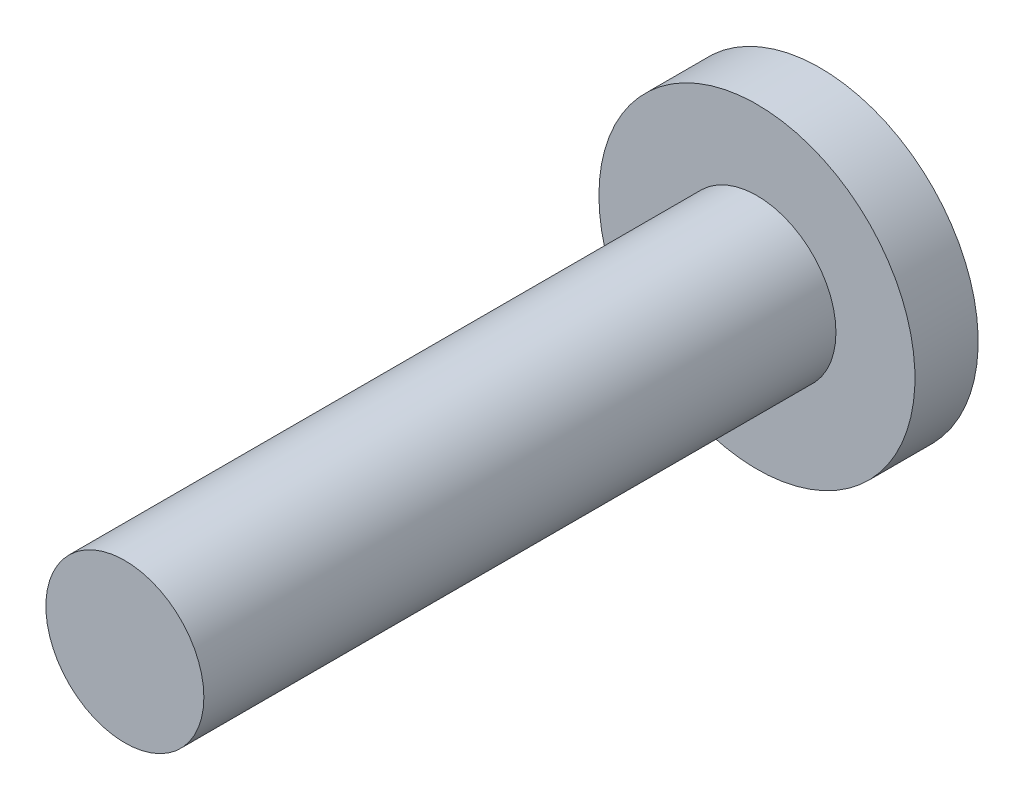
ISO-10303-21;
HEADER;
FILE_DESCRIPTION(('STEP AP214'),'2;1');
FILE_NAME('part.step','',(''),(''),'','','');
FILE_SCHEMA(('AUTOMOTIVE_DESIGN { 1 0 10303 214 1 1 1 1 }'));
ENDSEC;
DATA;
#1=APPLICATION_CONTEXT('core data for automotive mechanical design processes');
#2=APPLICATION_PROTOCOL_DEFINITION('international standard','automotive_design',2000,#1);
#3=PRODUCT_CONTEXT('',#1,'mechanical');
#4=PRODUCT('Part','Part','',(#3));
#5=PRODUCT_RELATED_PRODUCT_CATEGORY('part','',(#4));
#6=PRODUCT_DEFINITION_FORMATION('','',#4);
#7=PRODUCT_DEFINITION_CONTEXT('part definition',#1,'design');
#8=PRODUCT_DEFINITION('design','',#6,#7);
#9=PRODUCT_DEFINITION_SHAPE('','',#8);
#10=(LENGTH_UNIT() NAMED_UNIT(*) SI_UNIT(.MILLI.,.METRE.));
#11=(NAMED_UNIT(*) PLANE_ANGLE_UNIT() SI_UNIT($,.RADIAN.));
#12=(NAMED_UNIT(*) SI_UNIT($,.STERADIAN.) SOLID_ANGLE_UNIT());
#13=UNCERTAINTY_MEASURE_WITH_UNIT(LENGTH_MEASURE(1.E-05),#10,'distance_accuracy_value','');
#14=(GEOMETRIC_REPRESENTATION_CONTEXT(3) GLOBAL_UNCERTAINTY_ASSIGNED_CONTEXT((#13)) GLOBAL_UNIT_ASSIGNED_CONTEXT((#10,
#11,#12)) REPRESENTATION_CONTEXT('',''));
#15=CARTESIAN_POINT('',(0.,0.,0.));
#16=DIRECTION('',(0.,0.,1.));
#17=DIRECTION('',(1.,0.,0.));
#18=AXIS2_PLACEMENT_3D('',#15,#16,#17);
#19=CARTESIAN_POINT('',(0.,0.,25.4));
#20=DIRECTION('',(0.,0.,-1.));
#21=DIRECTION('',(-1.,0.,0.));
#22=AXIS2_PLACEMENT_3D('',#19,#20,#21);
#23=CYLINDRICAL_SURFACE('',#22,3.175);
#24=CARTESIAN_POINT('',(0.,0.,25.4));
#25=DIRECTION('',(0.,0.,1.));
#26=DIRECTION('',(1.,0.,0.));
#27=AXIS2_PLACEMENT_3D('',#24,#25,#26);
#28=CIRCLE('',#27,3.175);
#29=CARTESIAN_POINT('',(3.175,0.,25.4));
#30=VERTEX_POINT('',#29);
#31=EDGE_CURVE('E10',#30,#30,#28,.T.);
#32=ORIENTED_EDGE('',*,*,#31,.F.);
#33=EDGE_LOOP('',(#32));
#34=FACE_BOUND('',#33,.T.);
#35=CARTESIAN_POINT('',(0.,0.,0.));
#36=DIRECTION('',(0.,0.,1.));
#37=DIRECTION('',(1.,0.,0.));
#38=AXIS2_PLACEMENT_3D('',#35,#36,#37);
#39=CIRCLE('',#38,3.175);
#40=CARTESIAN_POINT('',(3.175,0.,0.));
#41=VERTEX_POINT('',#40);
#42=EDGE_CURVE('E40',#41,#41,#39,.T.);
#43=ORIENTED_EDGE('',*,*,#42,.T.);
#44=EDGE_LOOP('',(#43));
#45=FACE_BOUND('',#44,.T.);
#46=ADVANCED_FACE('F37',(#34,#45),#23,.T.);
#47=CARTESIAN_POINT('',(0.,0.,25.4));
#48=DIRECTION('',(0.,0.,1.));
#49=DIRECTION('',(1.,0.,0.));
#50=AXIS2_PLACEMENT_3D('',#47,#48,#49);
#51=PLANE('',#50);
#52=ORIENTED_EDGE('',*,*,#31,.T.);
#53=EDGE_LOOP('',(#52));
#54=FACE_BOUND('',#53,.T.);
#55=ADVANCED_FACE('F64',(#54),#51,.T.);
#56=CARTESIAN_POINT('',(0.,0.,-2.54));
#57=DIRECTION('',(0.,0.,1.));
#58=DIRECTION('',(1.,0.,0.));
#59=AXIS2_PLACEMENT_3D('',#56,#57,#58);
#60=CYLINDRICAL_SURFACE('',#59,6.35);
#61=CARTESIAN_POINT('',(0.,0.,-2.54));
#62=DIRECTION('',(0.,0.,-1.));
#63=DIRECTION('',(-1.,0.,0.));
#64=AXIS2_PLACEMENT_3D('',#61,#62,#63);
#65=CIRCLE('',#64,6.35);
#66=CARTESIAN_POINT('',(-6.35,0.,-2.54));
#67=VERTEX_POINT('',#66);
#68=EDGE_CURVE('E49',#67,#67,#65,.T.);
#69=ORIENTED_EDGE('',*,*,#68,.F.);
#70=EDGE_LOOP('',(#69));
#71=FACE_BOUND('',#70,.T.);
#72=CARTESIAN_POINT('',(0.,0.,0.));
#73=DIRECTION('',(0.,0.,-1.));
#74=DIRECTION('',(-1.,0.,0.));
#75=AXIS2_PLACEMENT_3D('',#72,#73,#74);
#76=CIRCLE('',#75,6.35);
#77=CARTESIAN_POINT('',(-6.35,0.,0.));
#78=VERTEX_POINT('',#77);
#79=EDGE_CURVE('E51',#78,#78,#76,.T.);
#80=ORIENTED_EDGE('',*,*,#79,.T.);
#81=EDGE_LOOP('',(#80));
#82=FACE_BOUND('',#81,.T.);
#83=ADVANCED_FACE('F61',(#71,#82),#60,.T.);
#84=CARTESIAN_POINT('',(0.,0.,-2.54));
#85=DIRECTION('',(0.,0.,-1.));
#86=DIRECTION('',(-1.,0.,0.));
#87=AXIS2_PLACEMENT_3D('',#84,#85,#86);
#88=PLANE('',#87);
#89=ORIENTED_EDGE('',*,*,#68,.T.);
#90=EDGE_LOOP('',(#89));
#91=FACE_BOUND('',#90,.T.);
#92=ADVANCED_FACE('F59',(#91),#88,.T.);
#93=CARTESIAN_POINT('',(0.,0.,0.));
#94=DIRECTION('',(0.,0.,-1.));
#95=DIRECTION('',(-1.,0.,0.));
#96=AXIS2_PLACEMENT_3D('',#93,#94,#95);
#97=PLANE('',#96);
#98=ORIENTED_EDGE('',*,*,#42,.F.);
#99=EDGE_LOOP('',(#98));
#100=FACE_BOUND('',#99,.T.);
#101=ORIENTED_EDGE('',*,*,#79,.F.);
#102=EDGE_LOOP('',(#101));
#103=FACE_BOUND('',#102,.T.);
#104=ADVANCED_FACE('F68',(#100,#103),#97,.F.);
#105=CLOSED_SHELL('',(#46,#55,#83,#92,#104));
#106=MANIFOLD_SOLID_BREP('B2',#105);
#107=ADVANCED_BREP_SHAPE_REPRESENTATION('',(#18,#106),#14);
#108=SHAPE_DEFINITION_REPRESENTATION(#9,#107);
ENDSEC;
END-ISO-10303-21;
